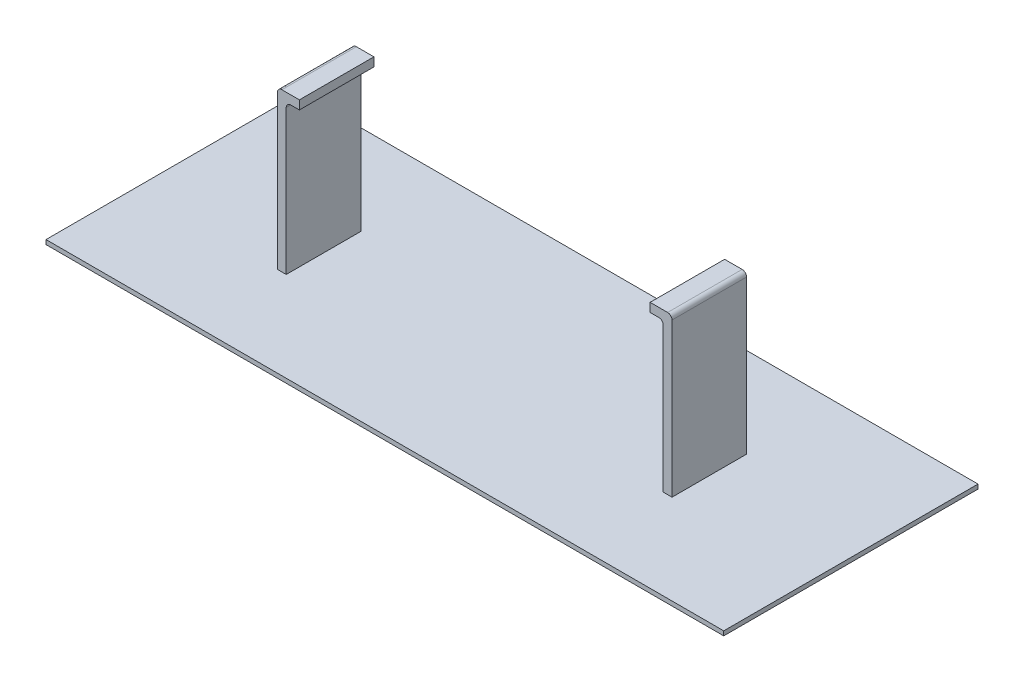
ISO-10303-21;
HEADER;
FILE_DESCRIPTION(('STEP AP214'),'2;1');
FILE_NAME('part.step','',(''),(''),'','','');
FILE_SCHEMA(('AUTOMOTIVE_DESIGN { 1 0 10303 214 1 1 1 1 }'));
ENDSEC;
DATA;
#1=APPLICATION_CONTEXT('core data for automotive mechanical design processes');
#2=APPLICATION_PROTOCOL_DEFINITION('international standard','automotive_design',2000,#1);
#3=PRODUCT_CONTEXT('',#1,'mechanical');
#4=PRODUCT('Part','Part','',(#3));
#5=PRODUCT_RELATED_PRODUCT_CATEGORY('part','',(#4));
#6=PRODUCT_DEFINITION_FORMATION('','',#4);
#7=PRODUCT_DEFINITION_CONTEXT('part definition',#1,'design');
#8=PRODUCT_DEFINITION('design','',#6,#7);
#9=PRODUCT_DEFINITION_SHAPE('','',#8);
#10=(LENGTH_UNIT() NAMED_UNIT(*) SI_UNIT(.MILLI.,.METRE.));
#11=(NAMED_UNIT(*) PLANE_ANGLE_UNIT() SI_UNIT($,.RADIAN.));
#12=(NAMED_UNIT(*) SI_UNIT($,.STERADIAN.) SOLID_ANGLE_UNIT());
#13=UNCERTAINTY_MEASURE_WITH_UNIT(LENGTH_MEASURE(1.E-05),#10,'distance_accuracy_value','');
#14=(GEOMETRIC_REPRESENTATION_CONTEXT(3) GLOBAL_UNCERTAINTY_ASSIGNED_CONTEXT((#13)) GLOBAL_UNIT_ASSIGNED_CONTEXT((#10,
#11,#12)) REPRESENTATION_CONTEXT('',''));
#15=CARTESIAN_POINT('',(0.,0.,0.));
#16=DIRECTION('',(0.,0.,1.));
#17=DIRECTION('',(1.,0.,0.));
#18=AXIS2_PLACEMENT_3D('',#15,#16,#17);
#19=CARTESIAN_POINT('',(9.965,3.32,2.9125));
#20=DIRECTION('',(0.,0.,-1.));
#21=DIRECTION('',(-1.,0.,0.));
#22=AXIS2_PLACEMENT_3D('',#19,#20,#21);
#23=CYLINDRICAL_SURFACE('',#22,0.05);
#24=CARTESIAN_POINT('',(9.965,3.32,3.125));
#25=DIRECTION('',(0.,0.,-1.));
#26=DIRECTION('',(-1.,0.,0.));
#27=AXIS2_PLACEMENT_3D('',#24,#25,#26);
#28=CIRCLE('',#27,0.05);
#29=CARTESIAN_POINT('',(9.965,3.37,3.125));
#30=VERTEX_POINT('',#29);
#31=CARTESIAN_POINT('',(9.915,3.32,3.125));
#32=VERTEX_POINT('',#31);
#33=EDGE_CURVE('E168',#30,#32,#28,.F.);
#34=ORIENTED_EDGE('',*,*,#33,.F.);
#35=DIRECTION('',(0.,0.,1.));
#36=VECTOR('',#35,1.);
#37=CARTESIAN_POINT('',(9.965,3.37,3.125));
#38=LINE('',#37,#36);
#39=CARTESIAN_POINT('',(9.965,3.37,2.275));
#40=VERTEX_POINT('',#39);
#41=EDGE_CURVE('E167',#40,#30,#38,.T.);
#42=ORIENTED_EDGE('',*,*,#41,.F.);
#43=CARTESIAN_POINT('',(9.965,3.32,2.275));
#44=DIRECTION('',(0.,0.,-1.));
#45=DIRECTION('',(-1.,0.,0.));
#46=AXIS2_PLACEMENT_3D('',#43,#44,#45);
#47=CIRCLE('',#46,0.05);
#48=CARTESIAN_POINT('',(9.915,3.32,2.275));
#49=VERTEX_POINT('',#48);
#50=EDGE_CURVE('E20',#49,#40,#47,.T.);
#51=ORIENTED_EDGE('',*,*,#50,.F.);
#52=DIRECTION('',(0.,0.,1.));
#53=VECTOR('',#52,1.);
#54=CARTESIAN_POINT('',(9.915,3.32,2.7));
#55=LINE('',#54,#53);
#56=EDGE_CURVE('E151',#32,#49,#55,.F.);
#57=ORIENTED_EDGE('',*,*,#56,.F.);
#58=EDGE_LOOP('',(#34,#42,#51,#57));
#59=FACE_BOUND('',#58,.T.);
#60=ADVANCED_FACE('F17',(#59),#23,.T.);
#61=CARTESIAN_POINT('',(10.065,3.22,2.275));
#62=DIRECTION('',(0.,0.,-1.));
#63=DIRECTION('',(-1.,0.,0.));
#64=AXIS2_PLACEMENT_3D('',#61,#62,#63);
#65=CYLINDRICAL_SURFACE('',#64,0.05);
#66=DIRECTION('',(0.,0.,-1.));
#67=VECTOR('',#66,1.);
#68=CARTESIAN_POINT('',(10.015,3.22,2.275));
#69=LINE('',#68,#67);
#70=CARTESIAN_POINT('',(10.015,3.22,2.275));
#71=VERTEX_POINT('',#70);
#72=CARTESIAN_POINT('',(10.015,3.22,3.125));
#73=VERTEX_POINT('',#72);
#74=EDGE_CURVE('E268',#71,#73,#69,.F.);
#75=ORIENTED_EDGE('',*,*,#74,.F.);
#76=CARTESIAN_POINT('',(10.065,3.22,2.275));
#77=DIRECTION('',(0.,0.,-1.));
#78=DIRECTION('',(-1.,0.,0.));
#79=AXIS2_PLACEMENT_3D('',#76,#77,#78);
#80=CIRCLE('',#79,0.05);
#81=CARTESIAN_POINT('',(10.065,3.27,2.275));
#82=VERTEX_POINT('',#81);
#83=EDGE_CURVE('E305',#82,#71,#80,.F.);
#84=ORIENTED_EDGE('',*,*,#83,.F.);
#85=DIRECTION('',(0.,0.,-1.));
#86=VECTOR('',#85,1.);
#87=CARTESIAN_POINT('',(10.065,3.27,2.275));
#88=LINE('',#87,#86);
#89=CARTESIAN_POINT('',(10.065,3.27,3.125));
#90=VERTEX_POINT('',#89);
#91=EDGE_CURVE('E264',#90,#82,#88,.T.);
#92=ORIENTED_EDGE('',*,*,#91,.F.);
#93=CARTESIAN_POINT('',(10.065,3.22,3.125));
#94=DIRECTION('',(0.,0.,-1.));
#95=DIRECTION('',(-1.,0.,0.));
#96=AXIS2_PLACEMENT_3D('',#93,#94,#95);
#97=CIRCLE('',#96,0.05);
#98=EDGE_CURVE('E301',#73,#90,#97,.T.);
#99=ORIENTED_EDGE('',*,*,#98,.F.);
#100=EDGE_LOOP('',(#75,#84,#92,#99));
#101=FACE_BOUND('',#100,.T.);
#102=ADVANCED_FACE('F461',(#101),#65,.F.);
#103=CARTESIAN_POINT('',(10.165,3.27,2.275));
#104=DIRECTION('',(0.,-1.,0.));
#105=DIRECTION('',(0.,0.,-1.));
#106=AXIS2_PLACEMENT_3D('',#103,#104,#105);
#107=PLANE('',#106);
#108=DIRECTION('',(0.,0.,1.));
#109=VECTOR('',#108,1.);
#110=CARTESIAN_POINT('',(10.165,3.27,2.7));
#111=LINE('',#110,#109);
#112=CARTESIAN_POINT('',(10.165,3.27,2.275));
#113=VERTEX_POINT('',#112);
#114=CARTESIAN_POINT('',(10.165,3.27,3.125));
#115=VERTEX_POINT('',#114);
#116=EDGE_CURVE('E173',#113,#115,#111,.T.);
#117=ORIENTED_EDGE('',*,*,#116,.T.);
#118=DIRECTION('',(1.,0.,0.));
#119=VECTOR('',#118,1.);
#120=CARTESIAN_POINT('',(10.165,3.27,3.125));
#121=LINE('',#120,#119);
#122=EDGE_CURVE('E259',#90,#115,#121,.T.);
#123=ORIENTED_EDGE('',*,*,#122,.F.);
#124=ORIENTED_EDGE('',*,*,#91,.T.);
#125=DIRECTION('',(-1.,0.,0.));
#126=VECTOR('',#125,1.);
#127=CARTESIAN_POINT('',(10.165,3.27,2.275));
#128=LINE('',#127,#126);
#129=EDGE_CURVE('E179',#113,#82,#128,.T.);
#130=ORIENTED_EDGE('',*,*,#129,.F.);
#131=EDGE_LOOP('',(#117,#123,#124,#130));
#132=FACE_BOUND('',#131,.T.);
#133=ADVANCED_FACE('F458',(#132),#107,.T.);
#134=CARTESIAN_POINT('',(10.165,3.32,2.7));
#135=DIRECTION('',(-1.,0.,0.));
#136=DIRECTION('',(0.,0.,1.));
#137=AXIS2_PLACEMENT_3D('',#134,#135,#136);
#138=PLANE('',#137);
#139=DIRECTION('',(0.,1.,0.));
#140=VECTOR('',#139,1.);
#141=CARTESIAN_POINT('',(10.165,3.37,2.275));
#142=LINE('',#141,#140);
#143=CARTESIAN_POINT('',(10.165,3.37,2.275));
#144=VERTEX_POINT('',#143);
#145=EDGE_CURVE('E177',#144,#113,#142,.F.);
#146=ORIENTED_EDGE('',*,*,#145,.F.);
#147=DIRECTION('',(0.,0.,1.));
#148=VECTOR('',#147,1.);
#149=CARTESIAN_POINT('',(10.165,3.37,3.125));
#150=LINE('',#149,#148);
#151=CARTESIAN_POINT('',(10.165,3.37,3.125));
#152=VERTEX_POINT('',#151);
#153=EDGE_CURVE('E172',#152,#144,#150,.F.);
#154=ORIENTED_EDGE('',*,*,#153,.F.);
#155=DIRECTION('',(0.,1.,0.));
#156=VECTOR('',#155,1.);
#157=CARTESIAN_POINT('',(10.165,3.27,3.125));
#158=LINE('',#157,#156);
#159=EDGE_CURVE('E256',#115,#152,#158,.T.);
#160=ORIENTED_EDGE('',*,*,#159,.F.);
#161=ORIENTED_EDGE('',*,*,#116,.F.);
#162=EDGE_LOOP('',(#146,#154,#160,#161));
#163=FACE_BOUND('',#162,.T.);
#164=ADVANCED_FACE('F455',(#163),#138,.F.);
#165=CARTESIAN_POINT('',(10.165,3.37,3.125));
#166=DIRECTION('',(0.,1.,0.));
#167=DIRECTION('',(0.,0.,1.));
#168=AXIS2_PLACEMENT_3D('',#165,#166,#167);
#169=PLANE('',#168);
#170=ORIENTED_EDGE('',*,*,#153,.T.);
#171=DIRECTION('',(-1.,0.,0.));
#172=VECTOR('',#171,1.);
#173=CARTESIAN_POINT('',(10.165,3.37,2.275));
#174=LINE('',#173,#172);
#175=EDGE_CURVE('E162',#40,#144,#174,.F.);
#176=ORIENTED_EDGE('',*,*,#175,.F.);
#177=ORIENTED_EDGE('',*,*,#41,.T.);
#178=DIRECTION('',(1.,0.,0.));
#179=VECTOR('',#178,1.);
#180=CARTESIAN_POINT('',(10.165,3.37,3.125));
#181=LINE('',#180,#179);
#182=EDGE_CURVE('E258',#152,#30,#181,.F.);
#183=ORIENTED_EDGE('',*,*,#182,.F.);
#184=EDGE_LOOP('',(#170,#176,#177,#183));
#185=FACE_BOUND('',#184,.T.);
#186=ADVANCED_FACE('F175',(#185),#169,.T.);
#187=CARTESIAN_POINT('',(14.265,3.22,3.125));
#188=DIRECTION('',(0.,0.,1.));
#189=DIRECTION('',(1.,0.,0.));
#190=AXIS2_PLACEMENT_3D('',#187,#188,#189);
#191=CYLINDRICAL_SURFACE('',#190,0.05);
#192=DIRECTION('',(0.,0.,1.));
#193=VECTOR('',#192,1.);
#194=CARTESIAN_POINT('',(14.315,3.22,3.125));
#195=LINE('',#194,#193);
#196=CARTESIAN_POINT('',(14.315,3.22,3.125));
#197=VERTEX_POINT('',#196);
#198=CARTESIAN_POINT('',(14.315,3.22,2.275));
#199=VERTEX_POINT('',#198);
#200=EDGE_CURVE('E233',#197,#199,#195,.F.);
#201=ORIENTED_EDGE('',*,*,#200,.F.);
#202=CARTESIAN_POINT('',(14.265,3.22,3.125));
#203=DIRECTION('',(0.,0.,1.));
#204=DIRECTION('',(1.,0.,0.));
#205=AXIS2_PLACEMENT_3D('',#202,#203,#204);
#206=CIRCLE('',#205,0.05);
#207=CARTESIAN_POINT('',(14.265,3.27,3.125));
#208=VERTEX_POINT('',#207);
#209=EDGE_CURVE('E236',#208,#197,#206,.F.);
#210=ORIENTED_EDGE('',*,*,#209,.F.);
#211=DIRECTION('',(0.,0.,-1.));
#212=VECTOR('',#211,1.);
#213=CARTESIAN_POINT('',(14.265,3.27,3.125));
#214=LINE('',#213,#212);
#215=CARTESIAN_POINT('',(14.265,3.27,2.275));
#216=VERTEX_POINT('',#215);
#217=EDGE_CURVE('E229',#216,#208,#214,.F.);
#218=ORIENTED_EDGE('',*,*,#217,.F.);
#219=CARTESIAN_POINT('',(14.265,3.22,2.275));
#220=DIRECTION('',(0.,0.,1.));
#221=DIRECTION('',(1.,0.,0.));
#222=AXIS2_PLACEMENT_3D('',#219,#220,#221);
#223=CIRCLE('',#222,0.05);
#224=EDGE_CURVE('E293',#199,#216,#223,.T.);
#225=ORIENTED_EDGE('',*,*,#224,.F.);
#226=EDGE_LOOP('',(#201,#210,#218,#225));
#227=FACE_BOUND('',#226,.T.);
#228=ADVANCED_FACE('F448',(#227),#191,.F.);
#229=CARTESIAN_POINT('',(14.165,3.27,3.125));
#230=DIRECTION('',(0.,-1.,0.));
#231=DIRECTION('',(0.,0.,-1.));
#232=AXIS2_PLACEMENT_3D('',#229,#230,#231);
#233=PLANE('',#232);
#234=DIRECTION('',(0.,0.,-1.));
#235=VECTOR('',#234,1.);
#236=CARTESIAN_POINT('',(14.165,3.27,2.7));
#237=LINE('',#236,#235);
#238=CARTESIAN_POINT('',(14.165,3.27,3.125));
#239=VERTEX_POINT('',#238);
#240=CARTESIAN_POINT('',(14.165,3.27,2.275));
#241=VERTEX_POINT('',#240);
#242=EDGE_CURVE('E219',#239,#241,#237,.T.);
#243=ORIENTED_EDGE('',*,*,#242,.T.);
#244=DIRECTION('',(-1.,0.,0.));
#245=VECTOR('',#244,1.);
#246=CARTESIAN_POINT('',(14.165,3.27,2.275));
#247=LINE('',#246,#245);
#248=EDGE_CURVE('E224',#216,#241,#247,.T.);
#249=ORIENTED_EDGE('',*,*,#248,.F.);
#250=ORIENTED_EDGE('',*,*,#217,.T.);
#251=DIRECTION('',(1.,0.,0.));
#252=VECTOR('',#251,1.);
#253=CARTESIAN_POINT('',(14.165,3.27,3.125));
#254=LINE('',#253,#252);
#255=EDGE_CURVE('E249',#239,#208,#254,.T.);
#256=ORIENTED_EDGE('',*,*,#255,.F.);
#257=EDGE_LOOP('',(#243,#249,#250,#256));
#258=FACE_BOUND('',#257,.T.);
#259=ADVANCED_FACE('F444',(#258),#233,.T.);
#260=CARTESIAN_POINT('',(14.165,3.32,2.7));
#261=DIRECTION('',(1.,0.,0.));
#262=DIRECTION('',(0.,0.,-1.));
#263=AXIS2_PLACEMENT_3D('',#260,#261,#262);
#264=PLANE('',#263);
#265=DIRECTION('',(0.,1.,0.));
#266=VECTOR('',#265,1.);
#267=CARTESIAN_POINT('',(14.165,3.37,3.125));
#268=LINE('',#267,#266);
#269=CARTESIAN_POINT('',(14.165,3.37,3.125));
#270=VERTEX_POINT('',#269);
#271=EDGE_CURVE('E246',#270,#239,#268,.F.);
#272=ORIENTED_EDGE('',*,*,#271,.F.);
#273=DIRECTION('',(0.,0.,1.));
#274=VECTOR('',#273,1.);
#275=CARTESIAN_POINT('',(14.165,3.37,2.275));
#276=LINE('',#275,#274);
#277=CARTESIAN_POINT('',(14.165,3.37,2.275));
#278=VERTEX_POINT('',#277);
#279=EDGE_CURVE('E216',#278,#270,#276,.T.);
#280=ORIENTED_EDGE('',*,*,#279,.F.);
#281=DIRECTION('',(0.,1.,0.));
#282=VECTOR('',#281,1.);
#283=CARTESIAN_POINT('',(14.165,3.27,2.275));
#284=LINE('',#283,#282);
#285=EDGE_CURVE('E222',#241,#278,#284,.T.);
#286=ORIENTED_EDGE('',*,*,#285,.F.);
#287=ORIENTED_EDGE('',*,*,#242,.F.);
#288=EDGE_LOOP('',(#272,#280,#286,#287));
#289=FACE_BOUND('',#288,.T.);
#290=ADVANCED_FACE('F440',(#289),#264,.F.);
#291=CARTESIAN_POINT('',(14.165,3.37,2.275));
#292=DIRECTION('',(0.,1.,0.));
#293=DIRECTION('',(0.,0.,1.));
#294=AXIS2_PLACEMENT_3D('',#291,#292,#293);
#295=PLANE('',#294);
#296=ORIENTED_EDGE('',*,*,#279,.T.);
#297=DIRECTION('',(1.,0.,0.));
#298=VECTOR('',#297,1.);
#299=CARTESIAN_POINT('',(14.165,3.37,3.125));
#300=LINE('',#299,#298);
#301=CARTESIAN_POINT('',(14.365,3.37,3.125));
#302=VERTEX_POINT('',#301);
#303=EDGE_CURVE('E250',#302,#270,#300,.F.);
#304=ORIENTED_EDGE('',*,*,#303,.F.);
#305=DIRECTION('',(0.,0.,1.));
#306=VECTOR('',#305,1.);
#307=CARTESIAN_POINT('',(14.365,3.37,2.4875));
#308=LINE('',#307,#306);
#309=CARTESIAN_POINT('',(14.365,3.37,2.275));
#310=VERTEX_POINT('',#309);
#311=EDGE_CURVE('E218',#310,#302,#308,.T.);
#312=ORIENTED_EDGE('',*,*,#311,.F.);
#313=DIRECTION('',(-1.,0.,0.));
#314=VECTOR('',#313,1.);
#315=CARTESIAN_POINT('',(14.165,3.37,2.275));
#316=LINE('',#315,#314);
#317=EDGE_CURVE('E190',#278,#310,#316,.F.);
#318=ORIENTED_EDGE('',*,*,#317,.F.);
#319=EDGE_LOOP('',(#296,#304,#312,#318));
#320=FACE_BOUND('',#319,.T.);
#321=ADVANCED_FACE('F436',(#320),#295,.T.);
#322=CARTESIAN_POINT('',(14.365,3.32,2.4875));
#323=DIRECTION('',(0.,0.,1.));
#324=DIRECTION('',(1.,0.,0.));
#325=AXIS2_PLACEMENT_3D('',#322,#323,#324);
#326=CYLINDRICAL_SURFACE('',#325,0.05);
#327=CARTESIAN_POINT('',(14.365,3.32,2.275));
#328=DIRECTION('',(0.,0.,1.));
#329=DIRECTION('',(1.,0.,0.));
#330=AXIS2_PLACEMENT_3D('',#327,#328,#329);
#331=CIRCLE('',#330,0.05);
#332=CARTESIAN_POINT('',(14.415,3.32,2.275));
#333=VERTEX_POINT('',#332);
#334=EDGE_CURVE('E243',#310,#333,#331,.F.);
#335=ORIENTED_EDGE('',*,*,#334,.F.);
#336=ORIENTED_EDGE('',*,*,#311,.T.);
#337=CARTESIAN_POINT('',(14.365,3.32,3.125));
#338=DIRECTION('',(0.,0.,1.));
#339=DIRECTION('',(1.,0.,0.));
#340=AXIS2_PLACEMENT_3D('',#337,#338,#339);
#341=CIRCLE('',#340,0.05);
#342=CARTESIAN_POINT('',(14.415,3.32,3.125));
#343=VERTEX_POINT('',#342);
#344=EDGE_CURVE('E298',#343,#302,#341,.T.);
#345=ORIENTED_EDGE('',*,*,#344,.F.);
#346=DIRECTION('',(0.,0.,-1.));
#347=VECTOR('',#346,1.);
#348=CARTESIAN_POINT('',(14.415,3.32,2.7));
#349=LINE('',#348,#347);
#350=EDGE_CURVE('E187',#333,#343,#349,.F.);
#351=ORIENTED_EDGE('',*,*,#350,.F.);
#352=EDGE_LOOP('',(#335,#336,#345,#351));
#353=FACE_BOUND('',#352,.T.);
#354=ADVANCED_FACE('F433',(#353),#326,.T.);
#355=CARTESIAN_POINT('',(9.915,3.32,2.7));
#356=DIRECTION('',(-1.,0.,0.));
#357=DIRECTION('',(0.,0.,1.));
#358=AXIS2_PLACEMENT_3D('',#355,#356,#357);
#359=PLANE('',#358);
#360=DIRECTION('',(0.,0.,1.));
#361=VECTOR('',#360,1.);
#362=CARTESIAN_POINT('',(9.915,1.57,2.7));
#363=LINE('',#362,#361);
#364=CARTESIAN_POINT('',(9.915,1.57,3.125));
#365=VERTEX_POINT('',#364);
#366=CARTESIAN_POINT('',(9.915,1.57,2.275));
#367=VERTEX_POINT('',#366);
#368=EDGE_CURVE('E194',#365,#367,#363,.F.);
#369=ORIENTED_EDGE('',*,*,#368,.F.);
#370=DIRECTION('',(0.,1.,0.));
#371=VECTOR('',#370,1.);
#372=CARTESIAN_POINT('',(9.915,3.27,3.125));
#373=LINE('',#372,#371);
#374=EDGE_CURVE('E304',#32,#365,#373,.F.);
#375=ORIENTED_EDGE('',*,*,#374,.F.);
#376=ORIENTED_EDGE('',*,*,#56,.T.);
#377=DIRECTION('',(0.,1.,0.));
#378=VECTOR('',#377,1.);
#379=CARTESIAN_POINT('',(9.915,3.37,2.275));
#380=LINE('',#379,#378);
#381=EDGE_CURVE('E164',#367,#49,#380,.T.);
#382=ORIENTED_EDGE('',*,*,#381,.F.);
#383=EDGE_LOOP('',(#369,#375,#376,#382));
#384=FACE_BOUND('',#383,.T.);
#385=ADVANCED_FACE('F430',(#384),#359,.T.);
#386=CARTESIAN_POINT('',(10.165,3.37,2.275));
#387=DIRECTION('',(0.,0.,-1.));
#388=DIRECTION('',(-1.,0.,0.));
#389=AXIS2_PLACEMENT_3D('',#386,#387,#388);
#390=PLANE('',#389);
#391=DIRECTION('',(1.,0.,0.));
#392=VECTOR('',#391,1.);
#393=CARTESIAN_POINT('',(12.165,1.57,2.275));
#394=LINE('',#393,#392);
#395=CARTESIAN_POINT('',(10.015,1.57,2.275));
#396=VERTEX_POINT('',#395);
#397=EDGE_CURVE('E273',#367,#396,#394,.T.);
#398=ORIENTED_EDGE('',*,*,#397,.F.);
#399=ORIENTED_EDGE('',*,*,#381,.T.);
#400=ORIENTED_EDGE('',*,*,#50,.T.);
#401=ORIENTED_EDGE('',*,*,#175,.T.);
#402=ORIENTED_EDGE('',*,*,#145,.T.);
#403=ORIENTED_EDGE('',*,*,#129,.T.);
#404=ORIENTED_EDGE('',*,*,#83,.T.);
#405=DIRECTION('',(0.,1.,0.));
#406=VECTOR('',#405,1.);
#407=CARTESIAN_POINT('',(10.015,3.27,2.275));
#408=LINE('',#407,#406);
#409=EDGE_CURVE('E270',#396,#71,#408,.T.);
#410=ORIENTED_EDGE('',*,*,#409,.F.);
#411=EDGE_LOOP('',(#398,#399,#400,#401,#402,#403,#404,#410));
#412=FACE_BOUND('',#411,.T.);
#413=ADVANCED_FACE('F159',(#412),#390,.T.);
#414=CARTESIAN_POINT('',(10.015,3.27,2.275));
#415=DIRECTION('',(1.,0.,0.));
#416=DIRECTION('',(0.,0.,-1.));
#417=AXIS2_PLACEMENT_3D('',#414,#415,#416);
#418=PLANE('',#417);
#419=DIRECTION('',(0.,0.,1.));
#420=VECTOR('',#419,1.);
#421=CARTESIAN_POINT('',(10.015,1.57,2.7));
#422=LINE('',#421,#420);
#423=CARTESIAN_POINT('',(10.015,1.57,3.125));
#424=VERTEX_POINT('',#423);
#425=EDGE_CURVE('E271',#396,#424,#422,.T.);
#426=ORIENTED_EDGE('',*,*,#425,.F.);
#427=ORIENTED_EDGE('',*,*,#409,.T.);
#428=ORIENTED_EDGE('',*,*,#74,.T.);
#429=DIRECTION('',(0.,1.,0.));
#430=VECTOR('',#429,1.);
#431=CARTESIAN_POINT('',(10.015,3.27,3.125));
#432=LINE('',#431,#430);
#433=EDGE_CURVE('E303',#424,#73,#432,.T.);
#434=ORIENTED_EDGE('',*,*,#433,.F.);
#435=EDGE_LOOP('',(#426,#427,#428,#434));
#436=FACE_BOUND('',#435,.T.);
#437=ADVANCED_FACE('F423',(#436),#418,.T.);
#438=CARTESIAN_POINT('',(10.165,3.27,3.125));
#439=DIRECTION('',(0.,0.,1.));
#440=DIRECTION('',(1.,0.,0.));
#441=AXIS2_PLACEMENT_3D('',#438,#439,#440);
#442=PLANE('',#441);
#443=ORIENTED_EDGE('',*,*,#159,.T.);
#444=ORIENTED_EDGE('',*,*,#182,.T.);
#445=ORIENTED_EDGE('',*,*,#33,.T.);
#446=ORIENTED_EDGE('',*,*,#374,.T.);
#447=DIRECTION('',(1.,0.,0.));
#448=VECTOR('',#447,1.);
#449=CARTESIAN_POINT('',(12.165,1.57,3.125));
#450=LINE('',#449,#448);
#451=EDGE_CURVE('E213',#424,#365,#450,.F.);
#452=ORIENTED_EDGE('',*,*,#451,.F.);
#453=ORIENTED_EDGE('',*,*,#433,.T.);
#454=ORIENTED_EDGE('',*,*,#98,.T.);
#455=ORIENTED_EDGE('',*,*,#122,.T.);
#456=EDGE_LOOP('',(#443,#444,#445,#446,#452,#453,#454,#455));
#457=FACE_BOUND('',#456,.T.);
#458=ADVANCED_FACE('F419',(#457),#442,.T.);
#459=CARTESIAN_POINT('',(14.165,3.37,3.125));
#460=DIRECTION('',(0.,0.,1.));
#461=DIRECTION('',(1.,0.,0.));
#462=AXIS2_PLACEMENT_3D('',#459,#460,#461);
#463=PLANE('',#462);
#464=DIRECTION('',(1.,0.,0.));
#465=VECTOR('',#464,1.);
#466=CARTESIAN_POINT('',(12.165,1.57,3.125));
#467=LINE('',#466,#465);
#468=CARTESIAN_POINT('',(14.415,1.57,3.125));
#469=VERTEX_POINT('',#468);
#470=CARTESIAN_POINT('',(14.315,1.57,3.125));
#471=VERTEX_POINT('',#470);
#472=EDGE_CURVE('E211',#469,#471,#467,.F.);
#473=ORIENTED_EDGE('',*,*,#472,.F.);
#474=DIRECTION('',(0.,1.,0.));
#475=VECTOR('',#474,1.);
#476=CARTESIAN_POINT('',(14.415,3.32,3.125));
#477=LINE('',#476,#475);
#478=EDGE_CURVE('E189',#343,#469,#477,.F.);
#479=ORIENTED_EDGE('',*,*,#478,.F.);
#480=ORIENTED_EDGE('',*,*,#344,.T.);
#481=ORIENTED_EDGE('',*,*,#303,.T.);
#482=ORIENTED_EDGE('',*,*,#271,.T.);
#483=ORIENTED_EDGE('',*,*,#255,.T.);
#484=ORIENTED_EDGE('',*,*,#209,.T.);
#485=DIRECTION('',(0.,1.,0.));
#486=VECTOR('',#485,1.);
#487=CARTESIAN_POINT('',(14.315,3.27,3.125));
#488=LINE('',#487,#486);
#489=EDGE_CURVE('E235',#471,#197,#488,.T.);
#490=ORIENTED_EDGE('',*,*,#489,.F.);
#491=EDGE_LOOP('',(#473,#479,#480,#481,#482,#483,#484,#490));
#492=FACE_BOUND('',#491,.T.);
#493=ADVANCED_FACE('F415',(#492),#463,.T.);
#494=CARTESIAN_POINT('',(14.315,3.27,3.125));
#495=DIRECTION('',(-1.,0.,0.));
#496=DIRECTION('',(0.,0.,1.));
#497=AXIS2_PLACEMENT_3D('',#494,#495,#496);
#498=PLANE('',#497);
#499=DIRECTION('',(0.,0.,1.));
#500=VECTOR('',#499,1.);
#501=CARTESIAN_POINT('',(14.315,1.57,2.7));
#502=LINE('',#501,#500);
#503=CARTESIAN_POINT('',(14.315,1.57,2.275));
#504=VERTEX_POINT('',#503);
#505=EDGE_CURVE('E200',#471,#504,#502,.F.);
#506=ORIENTED_EDGE('',*,*,#505,.F.);
#507=ORIENTED_EDGE('',*,*,#489,.T.);
#508=ORIENTED_EDGE('',*,*,#200,.T.);
#509=DIRECTION('',(0.,1.,0.));
#510=VECTOR('',#509,1.);
#511=CARTESIAN_POINT('',(14.315,3.27,2.275));
#512=LINE('',#511,#510);
#513=EDGE_CURVE('E295',#504,#199,#512,.T.);
#514=ORIENTED_EDGE('',*,*,#513,.F.);
#515=EDGE_LOOP('',(#506,#507,#508,#514));
#516=FACE_BOUND('',#515,.T.);
#517=ADVANCED_FACE('F411',(#516),#498,.T.);
#518=CARTESIAN_POINT('',(14.165,3.27,2.275));
#519=DIRECTION('',(0.,0.,-1.));
#520=DIRECTION('',(-1.,0.,0.));
#521=AXIS2_PLACEMENT_3D('',#518,#519,#520);
#522=PLANE('',#521);
#523=ORIENTED_EDGE('',*,*,#285,.T.);
#524=ORIENTED_EDGE('',*,*,#317,.T.);
#525=ORIENTED_EDGE('',*,*,#334,.T.);
#526=DIRECTION('',(0.,1.,0.));
#527=VECTOR('',#526,1.);
#528=CARTESIAN_POINT('',(14.415,3.32,2.275));
#529=LINE('',#528,#527);
#530=CARTESIAN_POINT('',(14.415,1.57,2.275));
#531=VERTEX_POINT('',#530);
#532=EDGE_CURVE('E191',#531,#333,#529,.T.);
#533=ORIENTED_EDGE('',*,*,#532,.F.);
#534=DIRECTION('',(1.,0.,0.));
#535=VECTOR('',#534,1.);
#536=CARTESIAN_POINT('',(12.165,1.57,2.275));
#537=LINE('',#536,#535);
#538=EDGE_CURVE('E197',#504,#531,#537,.T.);
#539=ORIENTED_EDGE('',*,*,#538,.F.);
#540=ORIENTED_EDGE('',*,*,#513,.T.);
#541=ORIENTED_EDGE('',*,*,#224,.T.);
#542=ORIENTED_EDGE('',*,*,#248,.T.);
#543=EDGE_LOOP('',(#523,#524,#525,#533,#539,#540,#541,#542));
#544=FACE_BOUND('',#543,.T.);
#545=ADVANCED_FACE('F407',(#544),#522,.T.);
#546=CARTESIAN_POINT('',(14.415,3.32,2.7));
#547=DIRECTION('',(1.,0.,0.));
#548=DIRECTION('',(0.,0.,-1.));
#549=AXIS2_PLACEMENT_3D('',#546,#547,#548);
#550=PLANE('',#549);
#551=DIRECTION('',(0.,0.,1.));
#552=VECTOR('',#551,1.);
#553=CARTESIAN_POINT('',(14.415,1.57,2.7));
#554=LINE('',#553,#552);
#555=EDGE_CURVE('E199',#531,#469,#554,.T.);
#556=ORIENTED_EDGE('',*,*,#555,.F.);
#557=ORIENTED_EDGE('',*,*,#532,.T.);
#558=ORIENTED_EDGE('',*,*,#350,.T.);
#559=ORIENTED_EDGE('',*,*,#478,.T.);
#560=EDGE_LOOP('',(#556,#557,#558,#559));
#561=FACE_BOUND('',#560,.T.);
#562=ADVANCED_FACE('F403',(#561),#550,.T.);
#563=CARTESIAN_POINT('',(12.165,1.57,2.7));
#564=DIRECTION('',(0.,1.,0.));
#565=DIRECTION('',(0.,0.,1.));
#566=AXIS2_PLACEMENT_3D('',#563,#564,#565);
#567=PLANE('',#566);
#568=ORIENTED_EDGE('',*,*,#538,.T.);
#569=ORIENTED_EDGE('',*,*,#555,.T.);
#570=ORIENTED_EDGE('',*,*,#472,.T.);
#571=ORIENTED_EDGE('',*,*,#505,.T.);
#572=EDGE_LOOP('',(#568,#569,#570,#571));
#573=FACE_BOUND('',#572,.T.);
#574=ORIENTED_EDGE('',*,*,#425,.T.);
#575=ORIENTED_EDGE('',*,*,#451,.T.);
#576=ORIENTED_EDGE('',*,*,#368,.T.);
#577=ORIENTED_EDGE('',*,*,#397,.T.);
#578=EDGE_LOOP('',(#574,#575,#576,#577));
#579=FACE_BOUND('',#578,.T.);
#580=DIRECTION('',(-1.,0.,0.));
#581=VECTOR('',#580,1.);
#582=CARTESIAN_POINT('',(16.03,1.57,1.25));
#583=LINE('',#582,#581);
#584=CARTESIAN_POINT('',(8.3,1.57,1.25));
#585=VERTEX_POINT('',#584);
#586=CARTESIAN_POINT('',(16.03,1.57,1.25));
#587=VERTEX_POINT('',#586);
#588=EDGE_CURVE('E347',#585,#587,#583,.F.);
#589=ORIENTED_EDGE('',*,*,#588,.F.);
#590=DIRECTION('',(0.,0.,1.));
#591=VECTOR('',#590,1.);
#592=CARTESIAN_POINT('',(8.3,1.57,1.25));
#593=LINE('',#592,#591);
#594=CARTESIAN_POINT('',(8.3,1.57,4.15));
#595=VERTEX_POINT('',#594);
#596=EDGE_CURVE('E351',#595,#585,#593,.F.);
#597=ORIENTED_EDGE('',*,*,#596,.F.);
#598=DIRECTION('',(1.,0.,0.));
#599=VECTOR('',#598,1.);
#600=CARTESIAN_POINT('',(8.3,1.57,4.15));
#601=LINE('',#600,#599);
#602=CARTESIAN_POINT('',(16.03,1.57,4.15));
#603=VERTEX_POINT('',#602);
#604=EDGE_CURVE('E358',#603,#595,#601,.F.);
#605=ORIENTED_EDGE('',*,*,#604,.F.);
#606=DIRECTION('',(0.,0.,-1.));
#607=VECTOR('',#606,1.);
#608=CARTESIAN_POINT('',(16.03,1.57,4.15));
#609=LINE('',#608,#607);
#610=EDGE_CURVE('E205',#587,#603,#609,.F.);
#611=ORIENTED_EDGE('',*,*,#610,.F.);
#612=EDGE_LOOP('',(#589,#597,#605,#611));
#613=FACE_BOUND('',#612,.T.);
#614=ADVANCED_FACE('F400',(#573,#579,#613),#567,.T.);
#615=CARTESIAN_POINT('',(16.03,1.52,4.15));
#616=DIRECTION('',(1.,0.,0.));
#617=DIRECTION('',(0.,0.,-1.));
#618=AXIS2_PLACEMENT_3D('',#615,#616,#617);
#619=PLANE('',#618);
#620=ORIENTED_EDGE('',*,*,#610,.T.);
#621=DIRECTION('',(0.,1.,0.));
#622=VECTOR('',#621,1.);
#623=CARTESIAN_POINT('',(16.03,1.52,4.15));
#624=LINE('',#623,#622);
#625=CARTESIAN_POINT('',(16.03,1.52,4.15));
#626=VERTEX_POINT('',#625);
#627=EDGE_CURVE('E355',#626,#603,#624,.T.);
#628=ORIENTED_EDGE('',*,*,#627,.F.);
#629=DIRECTION('',(0.,0.,1.));
#630=VECTOR('',#629,1.);
#631=CARTESIAN_POINT('',(16.03,1.52,2.7));
#632=LINE('',#631,#630);
#633=CARTESIAN_POINT('',(16.03,1.52,1.25));
#634=VERTEX_POINT('',#633);
#635=EDGE_CURVE('E361',#626,#634,#632,.F.);
#636=ORIENTED_EDGE('',*,*,#635,.T.);
#637=DIRECTION('',(0.,1.,0.));
#638=VECTOR('',#637,1.);
#639=CARTESIAN_POINT('',(16.03,1.52,1.25));
#640=LINE('',#639,#638);
#641=EDGE_CURVE('E349',#587,#634,#640,.F.);
#642=ORIENTED_EDGE('',*,*,#641,.F.);
#643=EDGE_LOOP('',(#620,#628,#636,#642));
#644=FACE_BOUND('',#643,.T.);
#645=ADVANCED_FACE('F381',(#644),#619,.T.);
#646=CARTESIAN_POINT('',(16.03,1.52,1.25));
#647=DIRECTION('',(0.,0.,-1.));
#648=DIRECTION('',(-1.,0.,0.));
#649=AXIS2_PLACEMENT_3D('',#646,#647,#648);
#650=PLANE('',#649);
#651=ORIENTED_EDGE('',*,*,#588,.T.);
#652=ORIENTED_EDGE('',*,*,#641,.T.);
#653=DIRECTION('',(1.,0.,0.));
#654=VECTOR('',#653,1.);
#655=CARTESIAN_POINT('',(12.165,1.52,1.25));
#656=LINE('',#655,#654);
#657=CARTESIAN_POINT('',(8.3,1.52,1.25));
#658=VERTEX_POINT('',#657);
#659=EDGE_CURVE('E364',#634,#658,#656,.F.);
#660=ORIENTED_EDGE('',*,*,#659,.T.);
#661=DIRECTION('',(0.,1.,0.));
#662=VECTOR('',#661,1.);
#663=CARTESIAN_POINT('',(8.3,1.52,1.25));
#664=LINE('',#663,#662);
#665=EDGE_CURVE('E353',#585,#658,#664,.F.);
#666=ORIENTED_EDGE('',*,*,#665,.F.);
#667=EDGE_LOOP('',(#651,#652,#660,#666));
#668=FACE_BOUND('',#667,.T.);
#669=ADVANCED_FACE('F376',(#668),#650,.T.);
#670=CARTESIAN_POINT('',(8.3,1.52,1.25));
#671=DIRECTION('',(-1.,0.,0.));
#672=DIRECTION('',(0.,0.,1.));
#673=AXIS2_PLACEMENT_3D('',#670,#671,#672);
#674=PLANE('',#673);
#675=ORIENTED_EDGE('',*,*,#596,.T.);
#676=ORIENTED_EDGE('',*,*,#665,.T.);
#677=DIRECTION('',(0.,0.,1.));
#678=VECTOR('',#677,1.);
#679=CARTESIAN_POINT('',(8.3,1.52,2.7));
#680=LINE('',#679,#678);
#681=CARTESIAN_POINT('',(8.3,1.52,4.15));
#682=VERTEX_POINT('',#681);
#683=EDGE_CURVE('E26',#658,#682,#680,.T.);
#684=ORIENTED_EDGE('',*,*,#683,.T.);
#685=DIRECTION('',(0.,1.,0.));
#686=VECTOR('',#685,1.);
#687=CARTESIAN_POINT('',(8.3,1.52,4.15));
#688=LINE('',#687,#686);
#689=EDGE_CURVE('E34',#595,#682,#688,.F.);
#690=ORIENTED_EDGE('',*,*,#689,.F.);
#691=EDGE_LOOP('',(#675,#676,#684,#690));
#692=FACE_BOUND('',#691,.T.);
#693=ADVANCED_FACE('F370',(#692),#674,.T.);
#694=CARTESIAN_POINT('',(8.3,1.52,4.15));
#695=DIRECTION('',(0.,0.,1.));
#696=DIRECTION('',(1.,0.,0.));
#697=AXIS2_PLACEMENT_3D('',#694,#695,#696);
#698=PLANE('',#697);
#699=ORIENTED_EDGE('',*,*,#604,.T.);
#700=ORIENTED_EDGE('',*,*,#689,.T.);
#701=DIRECTION('',(1.,0.,0.));
#702=VECTOR('',#701,1.);
#703=CARTESIAN_POINT('',(12.165,1.52,4.15));
#704=LINE('',#703,#702);
#705=EDGE_CURVE('E11',#682,#626,#704,.T.);
#706=ORIENTED_EDGE('',*,*,#705,.T.);
#707=ORIENTED_EDGE('',*,*,#627,.T.);
#708=EDGE_LOOP('',(#699,#700,#706,#707));
#709=FACE_BOUND('',#708,.T.);
#710=ADVANCED_FACE('F384',(#709),#698,.T.);
#711=CARTESIAN_POINT('',(12.165,1.52,2.7));
#712=DIRECTION('',(0.,1.,0.));
#713=DIRECTION('',(0.,0.,1.));
#714=AXIS2_PLACEMENT_3D('',#711,#712,#713);
#715=PLANE('',#714);
#716=ORIENTED_EDGE('',*,*,#683,.F.);
#717=ORIENTED_EDGE('',*,*,#659,.F.);
#718=ORIENTED_EDGE('',*,*,#635,.F.);
#719=ORIENTED_EDGE('',*,*,#705,.F.);
#720=EDGE_LOOP('',(#716,#717,#718,#719));
#721=FACE_BOUND('',#720,.T.);
#722=ADVANCED_FACE('F374',(#721),#715,.F.);
#723=CLOSED_SHELL('',(#60,#102,#133,#164,#186,#228,#259,#290,#321,#354,#385,#413,#437,#458,#493,
#517,#545,#562,#614,#645,#669,#693,#710,#722));
#724=MANIFOLD_SOLID_BREP('B1',#723);
#725=ADVANCED_BREP_SHAPE_REPRESENTATION('',(#18,#724),#14);
#726=SHAPE_DEFINITION_REPRESENTATION(#9,#725);
ENDSEC;
END-ISO-10303-21;
